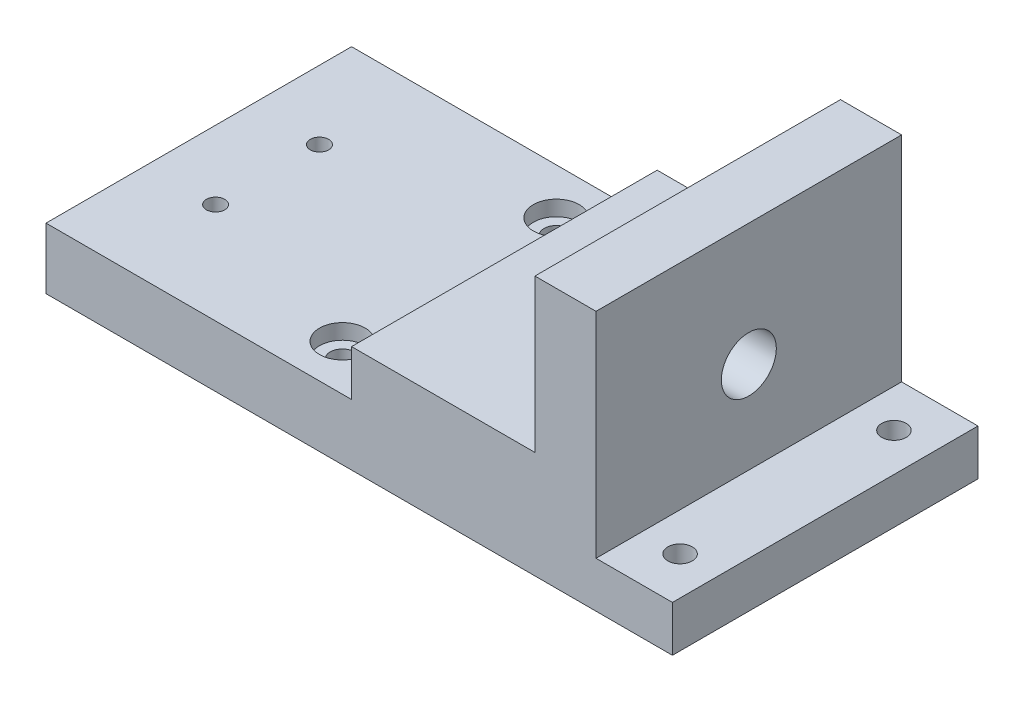
ISO-10303-21;
HEADER;
FILE_DESCRIPTION(('STEP AP214'),'2;1');
FILE_NAME('part.step','',(''),(''),'','','');
FILE_SCHEMA(('AUTOMOTIVE_DESIGN { 1 0 10303 214 1 1 1 1 }'));
ENDSEC;
DATA;
#1=APPLICATION_CONTEXT('core data for automotive mechanical design processes');
#2=APPLICATION_PROTOCOL_DEFINITION('international standard','automotive_design',2000,#1);
#3=PRODUCT_CONTEXT('',#1,'mechanical');
#4=PRODUCT('Part','Part','',(#3));
#5=PRODUCT_RELATED_PRODUCT_CATEGORY('part','',(#4));
#6=PRODUCT_DEFINITION_FORMATION('','',#4);
#7=PRODUCT_DEFINITION_CONTEXT('part definition',#1,'design');
#8=PRODUCT_DEFINITION('design','',#6,#7);
#9=PRODUCT_DEFINITION_SHAPE('','',#8);
#10=(LENGTH_UNIT() NAMED_UNIT(*) SI_UNIT(.MILLI.,.METRE.));
#11=(NAMED_UNIT(*) PLANE_ANGLE_UNIT() SI_UNIT($,.RADIAN.));
#12=(NAMED_UNIT(*) SI_UNIT($,.STERADIAN.) SOLID_ANGLE_UNIT());
#13=UNCERTAINTY_MEASURE_WITH_UNIT(LENGTH_MEASURE(1.E-05),#10,'distance_accuracy_value','');
#14=(GEOMETRIC_REPRESENTATION_CONTEXT(3) GLOBAL_UNCERTAINTY_ASSIGNED_CONTEXT((#13)) GLOBAL_UNIT_ASSIGNED_CONTEXT((#10,
#11,#12)) REPRESENTATION_CONTEXT('',''));
#15=CARTESIAN_POINT('',(0.,0.,0.));
#16=DIRECTION('',(0.,0.,1.));
#17=DIRECTION('',(1.,0.,0.));
#18=AXIS2_PLACEMENT_3D('',#15,#16,#17);
#19=CARTESIAN_POINT('',(-105.,20.,50.));
#20=DIRECTION('',(0.,-1.,0.));
#21=DIRECTION('',(1.,0.,0.));
#22=AXIS2_PLACEMENT_3D('',#19,#20,#21);
#23=PLANE('',#22);
#24=DIRECTION('',(-1.,0.,0.));
#25=VECTOR('',#24,1.);
#26=CARTESIAN_POINT('',(-105.,20.,-50.));
#27=LINE('',#26,#25);
#28=CARTESIAN_POINT('',(-105.,20.,-50.));
#29=VERTEX_POINT('',#28);
#30=CARTESIAN_POINT('',(-205.,20.,-50.));
#31=VERTEX_POINT('',#30);
#32=EDGE_CURVE('E86',#29,#31,#27,.T.);
#33=ORIENTED_EDGE('',*,*,#32,.T.);
#34=DIRECTION('',(0.,0.,-1.));
#35=VECTOR('',#34,1.);
#36=CARTESIAN_POINT('',(-205.,20.,50.));
#37=LINE('',#36,#35);
#38=CARTESIAN_POINT('',(-205.,20.,50.));
#39=VERTEX_POINT('',#38);
#40=EDGE_CURVE('E135',#39,#31,#37,.T.);
#41=ORIENTED_EDGE('',*,*,#40,.F.);
#42=DIRECTION('',(-1.,0.,0.));
#43=VECTOR('',#42,1.);
#44=CARTESIAN_POINT('',(-105.,20.,50.));
#45=LINE('',#44,#43);
#46=CARTESIAN_POINT('',(-105.,20.,50.));
#47=VERTEX_POINT('',#46);
#48=EDGE_CURVE('E123',#47,#39,#45,.T.);
#49=ORIENTED_EDGE('',*,*,#48,.F.);
#50=DIRECTION('',(0.,0.,-1.));
#51=VECTOR('',#50,1.);
#52=CARTESIAN_POINT('',(-105.,20.,50.));
#53=LINE('',#52,#51);
#54=EDGE_CURVE('E130',#47,#29,#53,.T.);
#55=ORIENTED_EDGE('',*,*,#54,.T.);
#56=EDGE_LOOP('',(#33,#41,#49,#55));
#57=FACE_BOUND('',#56,.T.);
#58=CARTESIAN_POINT('',(-182.5,20.,17.));
#59=DIRECTION('',(0.,-1.,0.));
#60=DIRECTION('',(1.,0.,0.));
#61=AXIS2_PLACEMENT_3D('',#58,#59,#60);
#62=CIRCLE('',#61,2.99999999999999);
#63=CARTESIAN_POINT('',(-179.5,20.,17.));
#64=VERTEX_POINT('',#63);
#65=EDGE_CURVE('E209',#64,#64,#62,.T.);
#66=ORIENTED_EDGE('',*,*,#65,.T.);
#67=EDGE_LOOP('',(#66));
#68=FACE_BOUND('',#67,.T.);
#69=CARTESIAN_POINT('',(-182.5,20.,-17.));
#70=DIRECTION('',(0.,1.,0.));
#71=DIRECTION('',(-1.,0.,0.));
#72=AXIS2_PLACEMENT_3D('',#69,#70,#71);
#73=CIRCLE('',#72,2.99999999999999);
#74=CARTESIAN_POINT('',(-185.5,20.,-17.));
#75=VERTEX_POINT('',#74);
#76=EDGE_CURVE('E218',#75,#75,#73,.T.);
#77=ORIENTED_EDGE('',*,*,#76,.F.);
#78=EDGE_LOOP('',(#77));
#79=FACE_BOUND('',#78,.T.);
#80=CARTESIAN_POINT('',(-123.,20.,-35.));
#81=DIRECTION('',(0.,1.,0.));
#82=DIRECTION('',(-1.,0.,0.));
#83=AXIS2_PLACEMENT_3D('',#80,#81,#82);
#84=CIRCLE('',#83,7.50000000000001);
#85=CARTESIAN_POINT('',(-130.5,20.,-35.));
#86=VERTEX_POINT('',#85);
#87=EDGE_CURVE('E198',#86,#86,#84,.T.);
#88=ORIENTED_EDGE('',*,*,#87,.F.);
#89=EDGE_LOOP('',(#88));
#90=FACE_BOUND('',#89,.T.);
#91=CARTESIAN_POINT('',(-123.,20.,35.));
#92=DIRECTION('',(0.,-1.,0.));
#93=DIRECTION('',(1.,0.,0.));
#94=AXIS2_PLACEMENT_3D('',#91,#92,#93);
#95=CIRCLE('',#94,7.50000000000001);
#96=CARTESIAN_POINT('',(-115.5,20.,35.));
#97=VERTEX_POINT('',#96);
#98=EDGE_CURVE('E203',#97,#97,#95,.T.);
#99=ORIENTED_EDGE('',*,*,#98,.T.);
#100=EDGE_LOOP('',(#99));
#101=FACE_BOUND('',#100,.T.);
#102=ADVANCED_FACE('F33',(#57,#68,#79,#90,#101),#23,.F.);
#103=CARTESIAN_POINT('',(-123.,0.,-35.));
#104=DIRECTION('',(0.,1.,0.));
#105=DIRECTION('',(-1.,0.,0.));
#106=AXIS2_PLACEMENT_3D('',#103,#104,#105);
#107=CYLINDRICAL_SURFACE('',#106,3.99999999999999);
#108=CARTESIAN_POINT('',(-123.,0.,-35.));
#109=DIRECTION('',(0.,1.,0.));
#110=DIRECTION('',(-1.,0.,0.));
#111=AXIS2_PLACEMENT_3D('',#108,#109,#110);
#112=CIRCLE('',#111,3.99999999999999);
#113=CARTESIAN_POINT('',(-127.,0.,-35.));
#114=VERTEX_POINT('',#113);
#115=EDGE_CURVE('E215',#114,#114,#112,.T.);
#116=ORIENTED_EDGE('',*,*,#115,.F.);
#117=EDGE_LOOP('',(#116));
#118=FACE_BOUND('',#117,.T.);
#119=CARTESIAN_POINT('',(-123.,15.,-35.));
#120=DIRECTION('',(0.,1.,0.));
#121=DIRECTION('',(-1.,0.,0.));
#122=AXIS2_PLACEMENT_3D('',#119,#120,#121);
#123=CIRCLE('',#122,3.99999999999999);
#124=CARTESIAN_POINT('',(-127.,15.,-35.));
#125=VERTEX_POINT('',#124);
#126=EDGE_CURVE('E190',#125,#125,#123,.F.);
#127=ORIENTED_EDGE('',*,*,#126,.F.);
#128=EDGE_LOOP('',(#127));
#129=FACE_BOUND('',#128,.T.);
#130=ADVANCED_FACE('F272',(#118,#129),#107,.F.);
#131=CARTESIAN_POINT('',(-205.,0.,50.));
#132=DIRECTION('',(0.,1.,0.));
#133=DIRECTION('',(0.,0.,1.));
#134=AXIS2_PLACEMENT_3D('',#131,#132,#133);
#135=PLANE('',#134);
#136=ORIENTED_EDGE('',*,*,#115,.T.);
#137=EDGE_LOOP('',(#136));
#138=FACE_BOUND('',#137,.T.);
#139=CARTESIAN_POINT('',(-182.5,0.,-17.));
#140=DIRECTION('',(0.,1.,0.));
#141=DIRECTION('',(-1.,0.,0.));
#142=AXIS2_PLACEMENT_3D('',#139,#140,#141);
#143=CIRCLE('',#142,2.99999999999999);
#144=CARTESIAN_POINT('',(-185.5,0.,-17.));
#145=VERTEX_POINT('',#144);
#146=EDGE_CURVE('E221',#145,#145,#143,.T.);
#147=ORIENTED_EDGE('',*,*,#146,.T.);
#148=EDGE_LOOP('',(#147));
#149=FACE_BOUND('',#148,.T.);
#150=CARTESIAN_POINT('',(-12.5,0.,-35.));
#151=DIRECTION('',(0.,1.,0.));
#152=DIRECTION('',(-1.,0.,0.));
#153=AXIS2_PLACEMENT_3D('',#150,#151,#152);
#154=CIRCLE('',#153,4.);
#155=CARTESIAN_POINT('',(-16.5,0.,-35.));
#156=VERTEX_POINT('',#155);
#157=EDGE_CURVE('E188',#156,#156,#154,.T.);
#158=ORIENTED_EDGE('',*,*,#157,.T.);
#159=EDGE_LOOP('',(#158));
#160=FACE_BOUND('',#159,.T.);
#161=DIRECTION('',(1.,0.,0.));
#162=VECTOR('',#161,1.);
#163=CARTESIAN_POINT('',(-205.,0.,-50.));
#164=LINE('',#163,#162);
#165=CARTESIAN_POINT('',(-205.,0.,-50.));
#166=VERTEX_POINT('',#165);
#167=CARTESIAN_POINT('',(0.,0.,-50.));
#168=VERTEX_POINT('',#167);
#169=EDGE_CURVE('E143',#166,#168,#164,.T.);
#170=ORIENTED_EDGE('',*,*,#169,.T.);
#171=DIRECTION('',(0.,0.,-1.));
#172=VECTOR('',#171,1.);
#173=CARTESIAN_POINT('',(0.,0.,50.));
#174=LINE('',#173,#172);
#175=CARTESIAN_POINT('',(0.,0.,50.));
#176=VERTEX_POINT('',#175);
#177=EDGE_CURVE('E11',#176,#168,#174,.T.);
#178=ORIENTED_EDGE('',*,*,#177,.F.);
#179=DIRECTION('',(1.,0.,0.));
#180=VECTOR('',#179,1.);
#181=CARTESIAN_POINT('',(-205.,0.,50.));
#182=LINE('',#181,#180);
#183=CARTESIAN_POINT('',(-205.,0.,50.));
#184=VERTEX_POINT('',#183);
#185=EDGE_CURVE('E164',#184,#176,#182,.T.);
#186=ORIENTED_EDGE('',*,*,#185,.F.);
#187=DIRECTION('',(0.,0.,-1.));
#188=VECTOR('',#187,1.);
#189=CARTESIAN_POINT('',(-205.,0.,50.));
#190=LINE('',#189,#188);
#191=EDGE_CURVE('E139',#184,#166,#190,.T.);
#192=ORIENTED_EDGE('',*,*,#191,.T.);
#193=EDGE_LOOP('',(#170,#178,#186,#192));
#194=FACE_BOUND('',#193,.T.);
#195=CARTESIAN_POINT('',(-182.5,0.,17.));
#196=DIRECTION('',(0.,-1.,0.));
#197=DIRECTION('',(1.,0.,0.));
#198=AXIS2_PLACEMENT_3D('',#195,#196,#197);
#199=CIRCLE('',#198,2.99999999999999);
#200=CARTESIAN_POINT('',(-179.5,0.,17.));
#201=VERTEX_POINT('',#200);
#202=EDGE_CURVE('E196',#201,#201,#199,.T.);
#203=ORIENTED_EDGE('',*,*,#202,.F.);
#204=EDGE_LOOP('',(#203));
#205=FACE_BOUND('',#204,.T.);
#206=CARTESIAN_POINT('',(-123.,0.,35.));
#207=DIRECTION('',(0.,-1.,0.));
#208=DIRECTION('',(1.,0.,0.));
#209=AXIS2_PLACEMENT_3D('',#206,#207,#208);
#210=CIRCLE('',#209,3.99999999999999);
#211=CARTESIAN_POINT('',(-119.,0.,35.));
#212=VERTEX_POINT('',#211);
#213=EDGE_CURVE('E212',#212,#212,#210,.T.);
#214=ORIENTED_EDGE('',*,*,#213,.F.);
#215=EDGE_LOOP('',(#214));
#216=FACE_BOUND('',#215,.T.);
#217=CARTESIAN_POINT('',(-12.5,0.,35.));
#218=DIRECTION('',(0.,-1.,0.));
#219=DIRECTION('',(1.,0.,0.));
#220=AXIS2_PLACEMENT_3D('',#217,#218,#219);
#221=CIRCLE('',#220,4.);
#222=CARTESIAN_POINT('',(-8.5,0.,35.));
#223=VERTEX_POINT('',#222);
#224=EDGE_CURVE('E224',#223,#223,#221,.T.);
#225=ORIENTED_EDGE('',*,*,#224,.F.);
#226=EDGE_LOOP('',(#225));
#227=FACE_BOUND('',#226,.T.);
#228=ADVANCED_FACE('F35',(#138,#149,#160,#194,#205,#216,#227),#135,.F.);
#229=CARTESIAN_POINT('',(0.,15.,50.));
#230=DIRECTION('',(0.,-1.,0.));
#231=DIRECTION('',(1.,0.,0.));
#232=AXIS2_PLACEMENT_3D('',#229,#230,#231);
#233=PLANE('',#232);
#234=CARTESIAN_POINT('',(-12.5,15.,35.));
#235=DIRECTION('',(0.,-1.,0.));
#236=DIRECTION('',(1.,0.,0.));
#237=AXIS2_PLACEMENT_3D('',#234,#235,#236);
#238=CIRCLE('',#237,4.);
#239=CARTESIAN_POINT('',(-8.5,15.,35.));
#240=VERTEX_POINT('',#239);
#241=EDGE_CURVE('E184',#240,#240,#238,.F.);
#242=ORIENTED_EDGE('',*,*,#241,.F.);
#243=EDGE_LOOP('',(#242));
#244=FACE_BOUND('',#243,.T.);
#245=CARTESIAN_POINT('',(-12.5,15.,-35.));
#246=DIRECTION('',(0.,-1.,0.));
#247=DIRECTION('',(1.,0.,0.));
#248=AXIS2_PLACEMENT_3D('',#245,#246,#247);
#249=CIRCLE('',#248,4.);
#250=CARTESIAN_POINT('',(-8.5,15.,-35.));
#251=VERTEX_POINT('',#250);
#252=EDGE_CURVE('E185',#251,#251,#249,.T.);
#253=ORIENTED_EDGE('',*,*,#252,.T.);
#254=EDGE_LOOP('',(#253));
#255=FACE_BOUND('',#254,.T.);
#256=DIRECTION('',(-1.,0.,0.));
#257=VECTOR('',#256,1.);
#258=CARTESIAN_POINT('',(0.,15.,-50.));
#259=LINE('',#258,#257);
#260=CARTESIAN_POINT('',(0.,15.,-50.));
#261=VERTEX_POINT('',#260);
#262=CARTESIAN_POINT('',(-25.,15.,-50.));
#263=VERTEX_POINT('',#262);
#264=EDGE_CURVE('E149',#261,#263,#259,.T.);
#265=ORIENTED_EDGE('',*,*,#264,.T.);
#266=DIRECTION('',(0.,0.,-1.));
#267=VECTOR('',#266,1.);
#268=CARTESIAN_POINT('',(-25.,15.,50.));
#269=LINE('',#268,#267);
#270=CARTESIAN_POINT('',(-25.,15.,50.));
#271=VERTEX_POINT('',#270);
#272=EDGE_CURVE('E176',#271,#263,#269,.T.);
#273=ORIENTED_EDGE('',*,*,#272,.F.);
#274=DIRECTION('',(-1.,0.,0.));
#275=VECTOR('',#274,1.);
#276=CARTESIAN_POINT('',(0.,15.,50.));
#277=LINE('',#276,#275);
#278=CARTESIAN_POINT('',(0.,15.,50.));
#279=VERTEX_POINT('',#278);
#280=EDGE_CURVE('E235',#279,#271,#277,.T.);
#281=ORIENTED_EDGE('',*,*,#280,.F.);
#282=DIRECTION('',(0.,0.,-1.));
#283=VECTOR('',#282,1.);
#284=CARTESIAN_POINT('',(0.,15.,50.));
#285=LINE('',#284,#283);
#286=EDGE_CURVE('E43',#279,#261,#285,.T.);
#287=ORIENTED_EDGE('',*,*,#286,.T.);
#288=EDGE_LOOP('',(#265,#273,#281,#287));
#289=FACE_BOUND('',#288,.T.);
#290=ADVANCED_FACE('F293',(#244,#255,#289),#233,.F.);
#291=CARTESIAN_POINT('',(0.,0.,50.));
#292=DIRECTION('',(-1.,0.,0.));
#293=DIRECTION('',(0.,0.,1.));
#294=AXIS2_PLACEMENT_3D('',#291,#292,#293);
#295=PLANE('',#294);
#296=DIRECTION('',(0.,1.,0.));
#297=VECTOR('',#296,1.);
#298=CARTESIAN_POINT('',(0.,0.,-50.));
#299=LINE('',#298,#297);
#300=EDGE_CURVE('E146',#168,#261,#299,.T.);
#301=ORIENTED_EDGE('',*,*,#300,.T.);
#302=ORIENTED_EDGE('',*,*,#286,.F.);
#303=DIRECTION('',(0.,1.,0.));
#304=VECTOR('',#303,1.);
#305=CARTESIAN_POINT('',(0.,0.,50.));
#306=LINE('',#305,#304);
#307=EDGE_CURVE('E100',#176,#279,#306,.T.);
#308=ORIENTED_EDGE('',*,*,#307,.F.);
#309=ORIENTED_EDGE('',*,*,#177,.T.);
#310=EDGE_LOOP('',(#301,#302,#308,#309));
#311=FACE_BOUND('',#310,.T.);
#312=ADVANCED_FACE('F291',(#311),#295,.F.);
#313=CARTESIAN_POINT('',(-25.,15.,50.));
#314=DIRECTION('',(-1.,0.,0.));
#315=DIRECTION('',(0.,0.,1.));
#316=AXIS2_PLACEMENT_3D('',#313,#314,#315);
#317=PLANE('',#316);
#318=CARTESIAN_POINT('',(-25.,45.,0.));
#319=DIRECTION('',(-1.,0.,0.));
#320=DIRECTION('',(0.,0.,1.));
#321=AXIS2_PLACEMENT_3D('',#318,#319,#320);
#322=CIRCLE('',#321,9.);
#323=CARTESIAN_POINT('',(-25.,45.,9.));
#324=VERTEX_POINT('',#323);
#325=EDGE_CURVE('E147',#324,#324,#322,.T.);
#326=ORIENTED_EDGE('',*,*,#325,.T.);
#327=EDGE_LOOP('',(#326));
#328=FACE_BOUND('',#327,.T.);
#329=DIRECTION('',(0.,1.,0.));
#330=VECTOR('',#329,1.);
#331=CARTESIAN_POINT('',(-25.,15.,-50.));
#332=LINE('',#331,#330);
#333=CARTESIAN_POINT('',(-25.,85.,-50.));
#334=VERTEX_POINT('',#333);
#335=EDGE_CURVE('E151',#263,#334,#332,.T.);
#336=ORIENTED_EDGE('',*,*,#335,.T.);
#337=DIRECTION('',(0.,0.,-1.));
#338=VECTOR('',#337,1.);
#339=CARTESIAN_POINT('',(-25.,85.,50.));
#340=LINE('',#339,#338);
#341=CARTESIAN_POINT('',(-25.,85.,50.));
#342=VERTEX_POINT('',#341);
#343=EDGE_CURVE('E173',#342,#334,#340,.T.);
#344=ORIENTED_EDGE('',*,*,#343,.F.);
#345=DIRECTION('',(0.,1.,0.));
#346=VECTOR('',#345,1.);
#347=CARTESIAN_POINT('',(-25.,15.,50.));
#348=LINE('',#347,#346);
#349=EDGE_CURVE('E237',#271,#342,#348,.T.);
#350=ORIENTED_EDGE('',*,*,#349,.F.);
#351=ORIENTED_EDGE('',*,*,#272,.T.);
#352=EDGE_LOOP('',(#336,#344,#350,#351));
#353=FACE_BOUND('',#352,.T.);
#354=ADVANCED_FACE('F287',(#328,#353),#317,.F.);
#355=CARTESIAN_POINT('',(-25.,85.,50.));
#356=DIRECTION('',(0.,-1.,0.));
#357=DIRECTION('',(0.,0.,-1.));
#358=AXIS2_PLACEMENT_3D('',#355,#356,#357);
#359=PLANE('',#358);
#360=DIRECTION('',(-1.,0.,0.));
#361=VECTOR('',#360,1.);
#362=CARTESIAN_POINT('',(-25.,85.,-50.));
#363=LINE('',#362,#361);
#364=CARTESIAN_POINT('',(-45.,85.,-50.));
#365=VERTEX_POINT('',#364);
#366=EDGE_CURVE('E153',#334,#365,#363,.T.);
#367=ORIENTED_EDGE('',*,*,#366,.T.);
#368=DIRECTION('',(0.,0.,-1.));
#369=VECTOR('',#368,1.);
#370=CARTESIAN_POINT('',(-45.,85.,50.));
#371=LINE('',#370,#369);
#372=CARTESIAN_POINT('',(-45.,85.,50.));
#373=VERTEX_POINT('',#372);
#374=EDGE_CURVE('E170',#373,#365,#371,.T.);
#375=ORIENTED_EDGE('',*,*,#374,.F.);
#376=DIRECTION('',(-1.,0.,0.));
#377=VECTOR('',#376,1.);
#378=CARTESIAN_POINT('',(-25.,85.,50.));
#379=LINE('',#378,#377);
#380=EDGE_CURVE('E239',#342,#373,#379,.T.);
#381=ORIENTED_EDGE('',*,*,#380,.F.);
#382=ORIENTED_EDGE('',*,*,#343,.T.);
#383=EDGE_LOOP('',(#367,#375,#381,#382));
#384=FACE_BOUND('',#383,.T.);
#385=ADVANCED_FACE('F283',(#384),#359,.F.);
#386=CARTESIAN_POINT('',(-45.,85.,50.));
#387=DIRECTION('',(1.,0.,0.));
#388=DIRECTION('',(0.,1.,0.));
#389=AXIS2_PLACEMENT_3D('',#386,#387,#388);
#390=PLANE('',#389);
#391=CARTESIAN_POINT('',(-45.,45.,0.));
#392=DIRECTION('',(1.,0.,0.));
#393=DIRECTION('',(0.,1.,0.));
#394=AXIS2_PLACEMENT_3D('',#391,#392,#393);
#395=CIRCLE('',#394,9.);
#396=CARTESIAN_POINT('',(-45.,54.,0.));
#397=VERTEX_POINT('',#396);
#398=EDGE_CURVE('E181',#397,#397,#395,.T.);
#399=ORIENTED_EDGE('',*,*,#398,.T.);
#400=EDGE_LOOP('',(#399));
#401=FACE_BOUND('',#400,.T.);
#402=DIRECTION('',(0.,-1.,0.));
#403=VECTOR('',#402,1.);
#404=CARTESIAN_POINT('',(-45.,85.,-50.));
#405=LINE('',#404,#403);
#406=CARTESIAN_POINT('',(-45.,35.,-50.));
#407=VERTEX_POINT('',#406);
#408=EDGE_CURVE('E155',#365,#407,#405,.T.);
#409=ORIENTED_EDGE('',*,*,#408,.T.);
#410=DIRECTION('',(0.,0.,-1.));
#411=VECTOR('',#410,1.);
#412=CARTESIAN_POINT('',(-45.,35.,50.));
#413=LINE('',#412,#411);
#414=CARTESIAN_POINT('',(-45.,35.,50.));
#415=VERTEX_POINT('',#414);
#416=EDGE_CURVE('E168',#415,#407,#413,.T.);
#417=ORIENTED_EDGE('',*,*,#416,.F.);
#418=DIRECTION('',(0.,-1.,0.));
#419=VECTOR('',#418,1.);
#420=CARTESIAN_POINT('',(-45.,85.,50.));
#421=LINE('',#420,#419);
#422=EDGE_CURVE('E241',#373,#415,#421,.T.);
#423=ORIENTED_EDGE('',*,*,#422,.F.);
#424=ORIENTED_EDGE('',*,*,#374,.T.);
#425=EDGE_LOOP('',(#409,#417,#423,#424));
#426=FACE_BOUND('',#425,.T.);
#427=ADVANCED_FACE('F247',(#401,#426),#390,.F.);
#428=CARTESIAN_POINT('',(-45.,35.,50.));
#429=DIRECTION('',(0.,-1.,0.));
#430=DIRECTION('',(1.,0.,0.));
#431=AXIS2_PLACEMENT_3D('',#428,#429,#430);
#432=PLANE('',#431);
#433=DIRECTION('',(-1.,0.,0.));
#434=VECTOR('',#433,1.);
#435=CARTESIAN_POINT('',(-45.,35.,-50.));
#436=LINE('',#435,#434);
#437=CARTESIAN_POINT('',(-105.,35.,-50.));
#438=VERTEX_POINT('',#437);
#439=EDGE_CURVE('E158',#407,#438,#436,.T.);
#440=ORIENTED_EDGE('',*,*,#439,.T.);
#441=DIRECTION('',(0.,0.,-1.));
#442=VECTOR('',#441,1.);
#443=CARTESIAN_POINT('',(-105.,35.,50.));
#444=LINE('',#443,#442);
#445=CARTESIAN_POINT('',(-105.,35.,50.));
#446=VERTEX_POINT('',#445);
#447=EDGE_CURVE('E134',#446,#438,#444,.T.);
#448=ORIENTED_EDGE('',*,*,#447,.F.);
#449=DIRECTION('',(-1.,0.,0.));
#450=VECTOR('',#449,1.);
#451=CARTESIAN_POINT('',(-45.,35.,50.));
#452=LINE('',#451,#450);
#453=EDGE_CURVE('E125',#415,#446,#452,.T.);
#454=ORIENTED_EDGE('',*,*,#453,.F.);
#455=ORIENTED_EDGE('',*,*,#416,.T.);
#456=EDGE_LOOP('',(#440,#448,#454,#455));
#457=FACE_BOUND('',#456,.T.);
#458=ADVANCED_FACE('F251',(#457),#432,.F.);
#459=CARTESIAN_POINT('',(-105.,35.,50.));
#460=DIRECTION('',(1.,0.,0.));
#461=DIRECTION('',(0.,0.,-1.));
#462=AXIS2_PLACEMENT_3D('',#459,#460,#461);
#463=PLANE('',#462);
#464=DIRECTION('',(0.,-1.,0.));
#465=VECTOR('',#464,1.);
#466=CARTESIAN_POINT('',(-105.,35.,-50.));
#467=LINE('',#466,#465);
#468=EDGE_CURVE('E133',#438,#29,#467,.T.);
#469=ORIENTED_EDGE('',*,*,#468,.T.);
#470=ORIENTED_EDGE('',*,*,#54,.F.);
#471=DIRECTION('',(0.,-1.,0.));
#472=VECTOR('',#471,1.);
#473=CARTESIAN_POINT('',(-105.,35.,50.));
#474=LINE('',#473,#472);
#475=EDGE_CURVE('E119',#446,#47,#474,.T.);
#476=ORIENTED_EDGE('',*,*,#475,.F.);
#477=ORIENTED_EDGE('',*,*,#447,.T.);
#478=EDGE_LOOP('',(#469,#470,#476,#477));
#479=FACE_BOUND('',#478,.T.);
#480=ADVANCED_FACE('F131',(#479),#463,.F.);
#481=CARTESIAN_POINT('',(-205.,20.,50.));
#482=DIRECTION('',(1.,0.,0.));
#483=DIRECTION('',(0.,1.,0.));
#484=AXIS2_PLACEMENT_3D('',#481,#482,#483);
#485=PLANE('',#484);
#486=DIRECTION('',(0.,-1.,0.));
#487=VECTOR('',#486,1.);
#488=CARTESIAN_POINT('',(-205.,20.,-50.));
#489=LINE('',#488,#487);
#490=EDGE_CURVE('E92',#31,#166,#489,.T.);
#491=ORIENTED_EDGE('',*,*,#490,.T.);
#492=ORIENTED_EDGE('',*,*,#191,.F.);
#493=DIRECTION('',(0.,-1.,0.));
#494=VECTOR('',#493,1.);
#495=CARTESIAN_POINT('',(-205.,20.,50.));
#496=LINE('',#495,#494);
#497=EDGE_CURVE('E52',#39,#184,#496,.T.);
#498=ORIENTED_EDGE('',*,*,#497,.F.);
#499=ORIENTED_EDGE('',*,*,#40,.T.);
#500=EDGE_LOOP('',(#491,#492,#498,#499));
#501=FACE_BOUND('',#500,.T.);
#502=ADVANCED_FACE('F260',(#501),#485,.F.);
#503=CARTESIAN_POINT('',(0.,0.,50.));
#504=DIRECTION('',(0.,0.,1.));
#505=DIRECTION('',(1.,0.,0.));
#506=AXIS2_PLACEMENT_3D('',#503,#504,#505);
#507=PLANE('',#506);
#508=ORIENTED_EDGE('',*,*,#185,.T.);
#509=ORIENTED_EDGE('',*,*,#307,.T.);
#510=ORIENTED_EDGE('',*,*,#280,.T.);
#511=ORIENTED_EDGE('',*,*,#349,.T.);
#512=ORIENTED_EDGE('',*,*,#380,.T.);
#513=ORIENTED_EDGE('',*,*,#422,.T.);
#514=ORIENTED_EDGE('',*,*,#453,.T.);
#515=ORIENTED_EDGE('',*,*,#475,.T.);
#516=ORIENTED_EDGE('',*,*,#48,.T.);
#517=ORIENTED_EDGE('',*,*,#497,.T.);
#518=EDGE_LOOP('',(#508,#509,#510,#511,#512,#513,#514,#515,#516,#517));
#519=FACE_BOUND('',#518,.T.);
#520=ADVANCED_FACE('F121',(#519),#507,.T.);
#521=CARTESIAN_POINT('',(0.,0.,-50.));
#522=DIRECTION('',(0.,0.,1.));
#523=DIRECTION('',(1.,0.,0.));
#524=AXIS2_PLACEMENT_3D('',#521,#522,#523);
#525=PLANE('',#524);
#526=ORIENTED_EDGE('',*,*,#169,.F.);
#527=ORIENTED_EDGE('',*,*,#490,.F.);
#528=ORIENTED_EDGE('',*,*,#32,.F.);
#529=ORIENTED_EDGE('',*,*,#468,.F.);
#530=ORIENTED_EDGE('',*,*,#439,.F.);
#531=ORIENTED_EDGE('',*,*,#408,.F.);
#532=ORIENTED_EDGE('',*,*,#366,.F.);
#533=ORIENTED_EDGE('',*,*,#335,.F.);
#534=ORIENTED_EDGE('',*,*,#264,.F.);
#535=ORIENTED_EDGE('',*,*,#300,.F.);
#536=EDGE_LOOP('',(#526,#527,#528,#529,#530,#531,#532,#533,#534,#535));
#537=FACE_BOUND('',#536,.T.);
#538=ADVANCED_FACE('F254',(#537),#525,.F.);
#539=CARTESIAN_POINT('',(-75.,45.,0.));
#540=DIRECTION('',(1.,0.,0.));
#541=DIRECTION('',(0.,0.,-1.));
#542=AXIS2_PLACEMENT_3D('',#539,#540,#541);
#543=CYLINDRICAL_SURFACE('',#542,9.);
#544=ORIENTED_EDGE('',*,*,#398,.F.);
#545=EDGE_LOOP('',(#544));
#546=FACE_BOUND('',#545,.T.);
#547=ORIENTED_EDGE('',*,*,#325,.F.);
#548=EDGE_LOOP('',(#547));
#549=FACE_BOUND('',#548,.T.);
#550=ADVANCED_FACE('F352',(#546,#549),#543,.F.);
#551=CARTESIAN_POINT('',(-182.5,0.,17.));
#552=DIRECTION('',(0.,1.,0.));
#553=DIRECTION('',(-1.,0.,0.));
#554=AXIS2_PLACEMENT_3D('',#551,#552,#553);
#555=CYLINDRICAL_SURFACE('',#554,2.99999999999999);
#556=ORIENTED_EDGE('',*,*,#202,.T.);
#557=EDGE_LOOP('',(#556));
#558=FACE_BOUND('',#557,.T.);
#559=ORIENTED_EDGE('',*,*,#65,.F.);
#560=EDGE_LOOP('',(#559));
#561=FACE_BOUND('',#560,.T.);
#562=ADVANCED_FACE('F347',(#558,#561),#555,.F.);
#563=CARTESIAN_POINT('',(-123.,0.,35.));
#564=DIRECTION('',(0.,1.,0.));
#565=DIRECTION('',(-1.,0.,0.));
#566=AXIS2_PLACEMENT_3D('',#563,#564,#565);
#567=CYLINDRICAL_SURFACE('',#566,3.99999999999999);
#568=CARTESIAN_POINT('',(-123.,15.,35.));
#569=DIRECTION('',(0.,-1.,0.));
#570=DIRECTION('',(1.,0.,0.));
#571=AXIS2_PLACEMENT_3D('',#568,#569,#570);
#572=CIRCLE('',#571,3.99999999999999);
#573=CARTESIAN_POINT('',(-119.,15.,35.));
#574=VERTEX_POINT('',#573);
#575=EDGE_CURVE('E37',#574,#574,#572,.T.);
#576=ORIENTED_EDGE('',*,*,#575,.F.);
#577=EDGE_LOOP('',(#576));
#578=FACE_BOUND('',#577,.T.);
#579=ORIENTED_EDGE('',*,*,#213,.T.);
#580=EDGE_LOOP('',(#579));
#581=FACE_BOUND('',#580,.T.);
#582=ADVANCED_FACE('F351',(#578,#581),#567,.F.);
#583=CARTESIAN_POINT('',(-182.5,0.,-17.));
#584=DIRECTION('',(0.,1.,0.));
#585=DIRECTION('',(-1.,0.,0.));
#586=AXIS2_PLACEMENT_3D('',#583,#584,#585);
#587=CYLINDRICAL_SURFACE('',#586,2.99999999999999);
#588=ORIENTED_EDGE('',*,*,#146,.F.);
#589=EDGE_LOOP('',(#588));
#590=FACE_BOUND('',#589,.T.);
#591=ORIENTED_EDGE('',*,*,#76,.T.);
#592=EDGE_LOOP('',(#591));
#593=FACE_BOUND('',#592,.T.);
#594=ADVANCED_FACE('F361',(#590,#593),#587,.F.);
#595=CARTESIAN_POINT('',(-12.5,0.,-35.));
#596=DIRECTION('',(0.,1.,0.));
#597=DIRECTION('',(-1.,0.,0.));
#598=AXIS2_PLACEMENT_3D('',#595,#596,#597);
#599=CYLINDRICAL_SURFACE('',#598,4.);
#600=ORIENTED_EDGE('',*,*,#157,.F.);
#601=EDGE_LOOP('',(#600));
#602=FACE_BOUND('',#601,.T.);
#603=ORIENTED_EDGE('',*,*,#252,.F.);
#604=EDGE_LOOP('',(#603));
#605=FACE_BOUND('',#604,.T.);
#606=ADVANCED_FACE('F366',(#602,#605),#599,.F.);
#607=CARTESIAN_POINT('',(-12.5,0.,35.));
#608=DIRECTION('',(0.,1.,0.));
#609=DIRECTION('',(-1.,0.,0.));
#610=AXIS2_PLACEMENT_3D('',#607,#608,#609);
#611=CYLINDRICAL_SURFACE('',#610,4.);
#612=ORIENTED_EDGE('',*,*,#224,.T.);
#613=EDGE_LOOP('',(#612));
#614=FACE_BOUND('',#613,.T.);
#615=ORIENTED_EDGE('',*,*,#241,.T.);
#616=EDGE_LOOP('',(#615));
#617=FACE_BOUND('',#616,.T.);
#618=ADVANCED_FACE('F376',(#614,#617),#611,.F.);
#619=CARTESIAN_POINT('',(-123.,15.,-35.));
#620=DIRECTION('',(0.,1.,0.));
#621=DIRECTION('',(-1.,0.,0.));
#622=AXIS2_PLACEMENT_3D('',#619,#620,#621);
#623=PLANE('',#622);
#624=CARTESIAN_POINT('',(-123.,15.,-35.));
#625=DIRECTION('',(0.,1.,0.));
#626=DIRECTION('',(-1.,0.,0.));
#627=AXIS2_PLACEMENT_3D('',#624,#625,#626);
#628=CIRCLE('',#627,7.50000000000001);
#629=CARTESIAN_POINT('',(-130.5,15.,-35.));
#630=VERTEX_POINT('',#629);
#631=EDGE_CURVE('E192',#630,#630,#628,.T.);
#632=ORIENTED_EDGE('',*,*,#631,.T.);
#633=EDGE_LOOP('',(#632));
#634=FACE_BOUND('',#633,.T.);
#635=ORIENTED_EDGE('',*,*,#126,.T.);
#636=EDGE_LOOP('',(#635));
#637=FACE_BOUND('',#636,.T.);
#638=ADVANCED_FACE('F385',(#634,#637),#623,.T.);
#639=CARTESIAN_POINT('',(-123.,15.,-35.));
#640=DIRECTION('',(0.,1.,0.));
#641=DIRECTION('',(-1.,0.,0.));
#642=AXIS2_PLACEMENT_3D('',#639,#640,#641);
#643=CYLINDRICAL_SURFACE('',#642,7.50000000000001);
#644=ORIENTED_EDGE('',*,*,#631,.F.);
#645=EDGE_LOOP('',(#644));
#646=FACE_BOUND('',#645,.T.);
#647=ORIENTED_EDGE('',*,*,#87,.T.);
#648=EDGE_LOOP('',(#647));
#649=FACE_BOUND('',#648,.T.);
#650=ADVANCED_FACE('F417',(#646,#649),#643,.F.);
#651=CARTESIAN_POINT('',(-123.,15.,35.));
#652=DIRECTION('',(0.,1.,0.));
#653=DIRECTION('',(-1.,0.,0.));
#654=AXIS2_PLACEMENT_3D('',#651,#652,#653);
#655=CYLINDRICAL_SURFACE('',#654,7.50000000000001);
#656=CARTESIAN_POINT('',(-123.,15.,35.));
#657=DIRECTION('',(0.,-1.,0.));
#658=DIRECTION('',(1.,0.,0.));
#659=AXIS2_PLACEMENT_3D('',#656,#657,#658);
#660=CIRCLE('',#659,7.50000000000001);
#661=CARTESIAN_POINT('',(-115.5,15.,35.));
#662=VERTEX_POINT('',#661);
#663=EDGE_CURVE('E206',#662,#662,#660,.T.);
#664=ORIENTED_EDGE('',*,*,#663,.T.);
#665=EDGE_LOOP('',(#664));
#666=FACE_BOUND('',#665,.T.);
#667=ORIENTED_EDGE('',*,*,#98,.F.);
#668=EDGE_LOOP('',(#667));
#669=FACE_BOUND('',#668,.T.);
#670=ADVANCED_FACE('F426',(#666,#669),#655,.F.);
#671=CARTESIAN_POINT('',(-123.,15.,35.));
#672=DIRECTION('',(0.,-1.,0.));
#673=DIRECTION('',(1.,0.,0.));
#674=AXIS2_PLACEMENT_3D('',#671,#672,#673);
#675=PLANE('',#674);
#676=ORIENTED_EDGE('',*,*,#575,.T.);
#677=EDGE_LOOP('',(#676));
#678=FACE_BOUND('',#677,.T.);
#679=ORIENTED_EDGE('',*,*,#663,.F.);
#680=EDGE_LOOP('',(#679));
#681=FACE_BOUND('',#680,.T.);
#682=ADVANCED_FACE('F436',(#678,#681),#675,.F.);
#683=CLOSED_SHELL('',(#102,#130,#228,#290,#312,#354,#385,#427,#458,#480,#502,#520,#538,#550,
#562,#582,#594,#606,#618,#638,#650,#670,#682));
#684=MANIFOLD_SOLID_BREP('B2',#683);
#685=ADVANCED_BREP_SHAPE_REPRESENTATION('',(#18,#684),#14);
#686=SHAPE_DEFINITION_REPRESENTATION(#9,#685);
ENDSEC;
END-ISO-10303-21;
